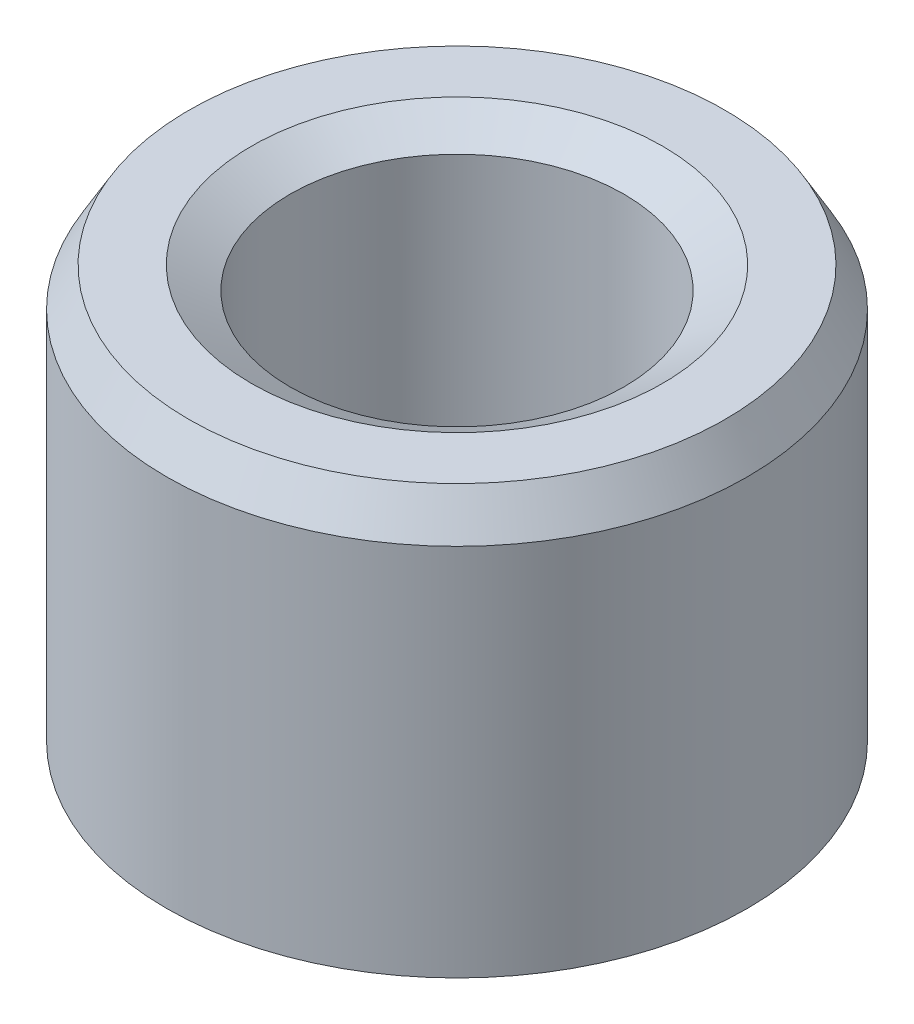
ISO-10303-21;
HEADER;
FILE_DESCRIPTION(('STEP AP214'),'2;1');
FILE_NAME('part.step','',(''),(''),'','','');
FILE_SCHEMA(('AUTOMOTIVE_DESIGN { 1 0 10303 214 1 1 1 1 }'));
ENDSEC;
DATA;
#1=APPLICATION_CONTEXT('core data for automotive mechanical design processes');
#2=APPLICATION_PROTOCOL_DEFINITION('international standard','automotive_design',2000,#1);
#3=PRODUCT_CONTEXT('',#1,'mechanical');
#4=PRODUCT('Part','Part','',(#3));
#5=PRODUCT_RELATED_PRODUCT_CATEGORY('part','',(#4));
#6=PRODUCT_DEFINITION_FORMATION('','',#4);
#7=PRODUCT_DEFINITION_CONTEXT('part definition',#1,'design');
#8=PRODUCT_DEFINITION('design','',#6,#7);
#9=PRODUCT_DEFINITION_SHAPE('','',#8);
#10=(LENGTH_UNIT() NAMED_UNIT(*) SI_UNIT(.MILLI.,.METRE.));
#11=(NAMED_UNIT(*) PLANE_ANGLE_UNIT() SI_UNIT($,.RADIAN.));
#12=(NAMED_UNIT(*) SI_UNIT($,.STERADIAN.) SOLID_ANGLE_UNIT());
#13=UNCERTAINTY_MEASURE_WITH_UNIT(LENGTH_MEASURE(1.E-05),#10,'distance_accuracy_value','');
#14=(GEOMETRIC_REPRESENTATION_CONTEXT(3) GLOBAL_UNCERTAINTY_ASSIGNED_CONTEXT((#13)) GLOBAL_UNIT_ASSIGNED_CONTEXT((#10,
#11,#12)) REPRESENTATION_CONTEXT('',''));
#15=CARTESIAN_POINT('',(0.,0.,0.));
#16=DIRECTION('',(0.,0.,1.));
#17=DIRECTION('',(1.,0.,0.));
#18=AXIS2_PLACEMENT_3D('',#15,#16,#17);
#19=CARTESIAN_POINT('',(0.,26.2063197438059,0.));
#20=DIRECTION('',(0.,-1.,0.));
#21=DIRECTION('',(0.,0.,-1.));
#22=AXIS2_PLACEMENT_3D('',#19,#20,#21);
#23=CYLINDRICAL_SURFACE('',#22,17.5);
#24=CARTESIAN_POINT('',(0.,1.34344800996524,0.));
#25=DIRECTION('',(0.,1.,0.));
#26=DIRECTION('',(0.,0.,1.));
#27=AXIS2_PLACEMENT_3D('',#24,#25,#26);
#28=CIRCLE('',#27,17.5);
#29=CARTESIAN_POINT('',(0.,1.34344800996524,17.5));
#30=VERTEX_POINT('',#29);
#31=EDGE_CURVE('E10',#30,#30,#28,.T.);
#32=ORIENTED_EDGE('',*,*,#31,.T.);
#33=EDGE_LOOP('',(#32));
#34=FACE_BOUND('',#33,.T.);
#35=CARTESIAN_POINT('',(0.,23.8793995332188,0.));
#36=DIRECTION('',(0.,1.,0.));
#37=DIRECTION('',(0.,0.,1.));
#38=AXIS2_PLACEMENT_3D('',#35,#36,#37);
#39=CIRCLE('',#38,17.5);
#40=CARTESIAN_POINT('',(0.,23.8793995332188,17.5));
#41=VERTEX_POINT('',#40);
#42=EDGE_CURVE('E50',#41,#41,#39,.F.);
#43=ORIENTED_EDGE('',*,*,#42,.T.);
#44=EDGE_LOOP('',(#43));
#45=FACE_BOUND('',#44,.T.);
#46=ADVANCED_FACE('F39',(#34,#45),#23,.T.);
#47=CARTESIAN_POINT('',(0.,26.2063197438059,0.));
#48=DIRECTION('',(0.,1.,0.));
#49=DIRECTION('',(0.,0.,1.));
#50=AXIS2_PLACEMENT_3D('',#47,#48,#49);
#51=PLANE('',#50);
#52=CARTESIAN_POINT('',(0.,26.2063197438059,0.));
#53=DIRECTION('',(0.,1.,0.));
#54=DIRECTION('',(0.,0.,1.));
#55=AXIS2_PLACEMENT_3D('',#52,#53,#54);
#56=CIRCLE('',#55,12.3940075327416);
#57=CARTESIAN_POINT('',(0.,26.2063197438059,12.3940075327416));
#58=VERTEX_POINT('',#57);
#59=EDGE_CURVE('E58',#58,#58,#56,.F.);
#60=ORIENTED_EDGE('',*,*,#59,.T.);
#61=EDGE_LOOP('',(#60));
#62=FACE_BOUND('',#61,.T.);
#63=CARTESIAN_POINT('',(0.,26.2063197438059,0.));
#64=DIRECTION('',(0.,1.,0.));
#65=DIRECTION('',(0.,0.,1.));
#66=AXIS2_PLACEMENT_3D('',#63,#64,#65);
#67=CIRCLE('',#66,16.1565519900348);
#68=CARTESIAN_POINT('',(0.,26.2063197438059,16.1565519900348));
#69=VERTEX_POINT('',#68);
#70=EDGE_CURVE('E61',#69,#69,#67,.T.);
#71=ORIENTED_EDGE('',*,*,#70,.T.);
#72=EDGE_LOOP('',(#71));
#73=FACE_BOUND('',#72,.T.);
#74=ADVANCED_FACE('F88',(#62,#73),#51,.T.);
#75=CARTESIAN_POINT('',(0.,0.,0.));
#76=DIRECTION('',(0.,1.,0.));
#77=DIRECTION('',(0.,0.,1.));
#78=AXIS2_PLACEMENT_3D('',#75,#76,#77);
#79=PLANE('',#78);
#80=CARTESIAN_POINT('',(0.,0.,0.));
#81=DIRECTION('',(0.,1.,0.));
#82=DIRECTION('',(0.,0.,1.));
#83=AXIS2_PLACEMENT_3D('',#80,#81,#82);
#84=CIRCLE('',#83,11.4105353321198);
#85=CARTESIAN_POINT('',(0.,0.,-11.4105353321198));
#86=VERTEX_POINT('',#85);
#87=EDGE_CURVE('E51',#86,#86,#84,.T.);
#88=ORIENTED_EDGE('',*,*,#87,.T.);
#89=EDGE_LOOP('',(#88));
#90=FACE_BOUND('',#89,.T.);
#91=CARTESIAN_POINT('',(0.,0.,0.));
#92=DIRECTION('',(0.,1.,0.));
#93=DIRECTION('',(0.,0.,1.));
#94=AXIS2_PLACEMENT_3D('',#91,#92,#93);
#95=CIRCLE('',#94,15.1730797894129);
#96=CARTESIAN_POINT('',(0.,0.,15.1730797894129));
#97=VERTEX_POINT('',#96);
#98=EDGE_CURVE('E54',#97,#97,#95,.F.);
#99=ORIENTED_EDGE('',*,*,#98,.T.);
#100=EDGE_LOOP('',(#99));
#101=FACE_BOUND('',#100,.T.);
#102=ADVANCED_FACE('F83',(#90,#101),#79,.F.);
#103=CARTESIAN_POINT('',(0.,26.2063197438059,0.));
#104=DIRECTION('',(0.,-1.,0.));
#105=DIRECTION('',(0.,0.,-1.));
#106=AXIS2_PLACEMENT_3D('',#103,#104,#105);
#107=CYLINDRICAL_SURFACE('',#106,10.0670873221545);
#108=CARTESIAN_POINT('',(0.,24.8628717338407,0.));
#109=DIRECTION('',(0.,1.,0.));
#110=DIRECTION('',(0.,0.,1.));
#111=AXIS2_PLACEMENT_3D('',#108,#109,#110);
#112=CIRCLE('',#111,10.0670873221545);
#113=CARTESIAN_POINT('',(0.,24.8628717338407,-10.0670873221545));
#114=VERTEX_POINT('',#113);
#115=EDGE_CURVE('E67',#114,#114,#112,.T.);
#116=CARTESIAN_POINT('',(0.,2.32692021058713,0.));
#117=DIRECTION('',(0.,1.,0.));
#118=DIRECTION('',(0.,0.,1.));
#119=AXIS2_PLACEMENT_3D('',#116,#117,#118);
#120=CIRCLE('',#119,10.0670873221545);
#121=CARTESIAN_POINT('',(0.,2.32692021058713,-10.0670873221545));
#122=VERTEX_POINT('',#121);
#123=EDGE_CURVE('E69',#122,#122,#120,.F.);
#124=CARTESIAN_POINT('',(0.,24.8628717338407,-10.0670873221545));
#125=CARTESIAN_POINT('',(0.,24.6281222388068,-10.0670873221545));
#126=CARTESIAN_POINT('',(0.,24.3933727437729,-10.0670873221545));
#127=CARTESIAN_POINT('',(0.,23.9238737537051,-10.0670873221545));
#128=CARTESIAN_POINT('',(0.,23.6891242586712,-10.0670873221545));
#129=CARTESIAN_POINT('',(0.,23.2196252686034,-10.0670873221545));
#130=CARTESIAN_POINT('',(0.,22.9848757735695,-10.0670873221545));
#131=CARTESIAN_POINT('',(0.,22.5153767835017,-10.0670873221545));
#132=CARTESIAN_POINT('',(0.,22.2806272884679,-10.0670873221545));
#133=CARTESIAN_POINT('',(0.,21.8111282984001,-10.0670873221545));
#134=CARTESIAN_POINT('',(0.,21.5763788033662,-10.0670873221545));
#135=CARTESIAN_POINT('',(0.,21.1068798132984,-10.0670873221545));
#136=CARTESIAN_POINT('',(0.,20.8721303182645,-10.0670873221545));
#137=CARTESIAN_POINT('',(0.,20.4026313281967,-10.0670873221545));
#138=CARTESIAN_POINT('',(0.,20.1678818331628,-10.0670873221545));
#139=CARTESIAN_POINT('',(0.,19.6983828430951,-10.0670873221545));
#140=CARTESIAN_POINT('',(0.,19.4636333480612,-10.0670873221545));
#141=CARTESIAN_POINT('',(0.,18.9941343579934,-10.0670873221545));
#142=CARTESIAN_POINT('',(0.,18.7593848629595,-10.0670873221545));
#143=CARTESIAN_POINT('',(0.,18.2898858728917,-10.0670873221545));
#144=CARTESIAN_POINT('',(0.,18.0551363778578,-10.0670873221545));
#145=CARTESIAN_POINT('',(0.,17.58563738779,-10.0670873221545));
#146=CARTESIAN_POINT('',(0.,17.3508878927561,-10.0670873221545));
#147=CARTESIAN_POINT('',(0.,16.8813889026884,-10.0670873221545));
#148=CARTESIAN_POINT('',(0.,16.6466394076545,-10.0670873221545));
#149=CARTESIAN_POINT('',(0.,16.1771404175867,-10.0670873221545));
#150=CARTESIAN_POINT('',(0.,15.9423909225528,-10.0670873221545));
#151=CARTESIAN_POINT('',(0.,15.472891932485,-10.0670873221545));
#152=CARTESIAN_POINT('',(0.,15.2381424374511,-10.0670873221545));
#153=CARTESIAN_POINT('',(0.,14.7686434473833,-10.0670873221545));
#154=CARTESIAN_POINT('',(0.,14.5338939523495,-10.0670873221545));
#155=CARTESIAN_POINT('',(0.,14.0643949622817,-10.0670873221545));
#156=CARTESIAN_POINT('',(0.,13.8296454672478,-10.0670873221545));
#157=CARTESIAN_POINT('',(0.,13.36014647718,-10.0670873221545));
#158=CARTESIAN_POINT('',(0.,13.1253969821461,-10.0670873221545));
#159=CARTESIAN_POINT('',(0.,12.6558979920783,-10.0670873221545));
#160=CARTESIAN_POINT('',(0.,12.4211484970444,-10.0670873221545));
#161=CARTESIAN_POINT('',(0.,11.9516495069767,-10.0670873221545));
#162=CARTESIAN_POINT('',(0.,11.7169000119428,-10.0670873221545));
#163=CARTESIAN_POINT('',(0.,11.247401021875,-10.0670873221545));
#164=CARTESIAN_POINT('',(0.,11.0126515268411,-10.0670873221545));
#165=CARTESIAN_POINT('',(0.,10.5431525367733,-10.0670873221545));
#166=CARTESIAN_POINT('',(0.,10.3084030417394,-10.0670873221545));
#167=CARTESIAN_POINT('',(0.,9.83890405167164,-10.0670873221545));
#168=CARTESIAN_POINT('',(0.,9.60415455663774,-10.0670873221545));
#169=CARTESIAN_POINT('',(0.,9.13465556656996,-10.0670873221545));
#170=CARTESIAN_POINT('',(0.,8.89990607153607,-10.0670873221545));
#171=CARTESIAN_POINT('',(0.,8.43040708146829,-10.0670873221545));
#172=CARTESIAN_POINT('',(0.,8.1956575864344,-10.0670873221545));
#173=CARTESIAN_POINT('',(0.,7.72615859636662,-10.0670873221545));
#174=CARTESIAN_POINT('',(0.,7.49140910133273,-10.0670873221545));
#175=CARTESIAN_POINT('',(0.,7.02191011126494,-10.0670873221545));
#176=CARTESIAN_POINT('',(0.,6.78716061623106,-10.0670873221545));
#177=CARTESIAN_POINT('',(0.,6.31766162616327,-10.0670873221545));
#178=CARTESIAN_POINT('',(0.,6.08291213112938,-10.0670873221545));
#179=CARTESIAN_POINT('',(0.,5.6134131410616,-10.0670873221545));
#180=CARTESIAN_POINT('',(0.,5.37866364602771,-10.0670873221545));
#181=CARTESIAN_POINT('',(0.,4.90916465595992,-10.0670873221545));
#182=CARTESIAN_POINT('',(0.,4.67441516092603,-10.0670873221545));
#183=CARTESIAN_POINT('',(0.,4.20491617085825,-10.0670873221545));
#184=CARTESIAN_POINT('',(0.,3.97016667582436,-10.0670873221545));
#185=CARTESIAN_POINT('',(0.,3.50066768575658,-10.0670873221545));
#186=CARTESIAN_POINT('',(0.,3.26591819072269,-10.0670873221545));
#187=CARTESIAN_POINT('',(0.,2.79641920065491,-10.0670873221545));
#188=CARTESIAN_POINT('',(0.,2.56166970562102,-10.0670873221545));
#189=CARTESIAN_POINT('',(0.,2.32692021058713,-10.0670873221545));
#190=B_SPLINE_CURVE_WITH_KNOTS('',3,(#124,#125,#126,#127,#128,#129,#130,#131,#132,#133,#134,
#135,#136,#137,#138,#139,#140,#141,#142,#143,#144,#145,#146,#147,#148,#149,#150,#151,#152,#153,
#154,#155,#156,#157,#158,#159,#160,#161,#162,#163,#164,#165,#166,#167,#168,#169,#170,#171,#172,
#173,#174,#175,#176,#177,#178,#179,#180,#181,#182,#183,#184,#185,#186,#187,#188,#189),
.UNSPECIFIED.,.F.,.F.,(4,2,2,2,2,2,2,2,2,2,2,2,2,2,2,2,2,2,2,2,2,2,2,2,2,2,2,2,2,2,2,2,4),(0.,
0.704248485101675,1.40849697020335,2.11274545530502,2.81699394040669,3.52124242550837,
4.22549091061004,4.92973939571171,5.63398788081338,6.33823636591506,7.04248485101673,
7.7467333361184,8.45098182122007,9.15523030632175,9.85947879142342,10.5637272765251,
11.2679757616268,11.9722242467284,12.6764727318301,13.3807212169318,14.0849697020335,
14.7892181871351,15.4934666722368,16.1977151573385,16.9019636424401,17.6062121275418,
18.3104606126435,19.0147090977452,19.7189575828468,20.4232060679485,21.1274545530502,
21.8317030381519,22.5359515232535),.UNSPECIFIED.);
#191=EDGE_CURVE('BSEAM71',#114,#122,#190,.T.);
#192=ORIENTED_EDGE('',*,*,#115,.T.);
#193=ORIENTED_EDGE('',*,*,#123,.T.);
#194=ORIENTED_EDGE('',*,*,#191,.T.);
#195=ORIENTED_EDGE('',*,*,#191,.F.);
#196=EDGE_LOOP('',(#192,#194,#193,#195));
#197=FACE_BOUND('',#196,.T.);
#198=ADVANCED_FACE('F71',(#197),#107,.F.);
#199=CARTESIAN_POINT('',(0.,24.8628717338407,0.));
#200=DIRECTION('',(0.,1.,0.));
#201=DIRECTION('',(0.,0.,1.));
#202=AXIS2_PLACEMENT_3D('',#199,#200,#201);
#203=CONICAL_SURFACE('',#202,10.0670873221545,1.0471975511966);
#204=ORIENTED_EDGE('',*,*,#59,.F.);
#205=EDGE_LOOP('',(#204));
#206=FACE_BOUND('',#205,.T.);
#207=ORIENTED_EDGE('',*,*,#115,.F.);
#208=EDGE_LOOP('',(#207));
#209=FACE_BOUND('',#208,.T.);
#210=ADVANCED_FACE('F77',(#206,#209),#203,.F.);
#211=CARTESIAN_POINT('',(0.,0.,0.));
#212=DIRECTION('',(0.,-1.,0.));
#213=DIRECTION('',(0.,0.,-1.));
#214=AXIS2_PLACEMENT_3D('',#211,#212,#213);
#215=CONICAL_SURFACE('',#214,11.4105353321198,0.523598775598295);
#216=CARTESIAN_POINT('',(0.,2.32692021058713,-10.0670873221545));
#217=CARTESIAN_POINT('',(0.,2.30268145839351,-10.0810815722583));
#218=CARTESIAN_POINT('',(0.,2.2784427061999,-10.0950758223621));
#219=CARTESIAN_POINT('',(0.,2.22996520181267,-10.1230643225697));
#220=CARTESIAN_POINT('',(0.,2.20572644961905,-10.1370585726735));
#221=CARTESIAN_POINT('',(0.,2.15724894523182,-10.1650470728811));
#222=CARTESIAN_POINT('',(0.,2.1330101930382,-10.1790413229849));
#223=CARTESIAN_POINT('',(0.,2.08453268865097,-10.2070298231926));
#224=CARTESIAN_POINT('',(0.,2.06029393645735,-10.2210240732964));
#225=CARTESIAN_POINT('',(0.,2.01181643207012,-10.249012573504));
#226=CARTESIAN_POINT('',(0.,1.98757767987651,-10.2630068236078));
#227=CARTESIAN_POINT('',(0.,1.93910017548928,-10.2909953238154));
#228=CARTESIAN_POINT('',(0.,1.91486142329566,-10.3049895739192));
#229=CARTESIAN_POINT('',(0.,1.86638391890843,-10.3329780741268));
#230=CARTESIAN_POINT('',(0.,1.84214516671481,-10.3469723242306));
#231=CARTESIAN_POINT('',(0.,1.79366766232758,-10.3749608244382));
#232=CARTESIAN_POINT('',(0.,1.76942891013396,-10.388955074542));
#233=CARTESIAN_POINT('',(0.,1.72095140574673,-10.4169435747496));
#234=CARTESIAN_POINT('',(0.,1.69671265355312,-10.4309378248534));
#235=CARTESIAN_POINT('',(0.,1.64823514916588,-10.458926325061));
#236=CARTESIAN_POINT('',(0.,1.62399639697227,-10.4729205751648));
#237=CARTESIAN_POINT('',(0.,1.57551889258504,-10.5009090753725));
#238=CARTESIAN_POINT('',(0.,1.55128014039142,-10.5149033254763));
#239=CARTESIAN_POINT('',(0.,1.50280263600419,-10.5428918256839));
#240=CARTESIAN_POINT('',(0.,1.47856388381057,-10.5568860757877));
#241=CARTESIAN_POINT('',(0.,1.43008637942334,-10.5848745759953));
#242=CARTESIAN_POINT('',(0.,1.40584762722972,-10.5988688260991));
#243=CARTESIAN_POINT('',(0.,1.35737012284249,-10.6268573263067));
#244=CARTESIAN_POINT('',(0.,1.33313137064888,-10.6408515764105));
#245=CARTESIAN_POINT('',(0.,1.28465386626164,-10.6688400766181));
#246=CARTESIAN_POINT('',(0.,1.26041511406803,-10.6828343267219));
#247=CARTESIAN_POINT('',(0.,1.2119376096808,-10.7108228269295));
#248=CARTESIAN_POINT('',(0.,1.18769885748718,-10.7248170770333));
#249=CARTESIAN_POINT('',(0.,1.13922135309995,-10.7528055772409));
#250=CARTESIAN_POINT('',(0.,1.11498260090633,-10.7667998273447));
#251=CARTESIAN_POINT('',(0.,1.0665050965191,-10.7947883275524));
#252=CARTESIAN_POINT('',(0.,1.04226634432549,-10.8087825776562));
#253=CARTESIAN_POINT('',(0.,0.993788839938254,-10.8367710778638));
#254=CARTESIAN_POINT('',(0.,0.969550087744637,-10.8507653279676));
#255=CARTESIAN_POINT('',(0.,0.921072583357406,-10.8787538281752));
#256=CARTESIAN_POINT('',(0.,0.89683383116379,-10.892748078279));
#257=CARTESIAN_POINT('',(0.,0.848356326776558,-10.9207365784866));
#258=CARTESIAN_POINT('',(0.,0.824117574582942,-10.9347308285904));
#259=CARTESIAN_POINT('',(0.,0.77564007019571,-10.962719328798));
#260=CARTESIAN_POINT('',(0.,0.751401318002094,-10.9767135789018));
#261=CARTESIAN_POINT('',(0.,0.702923813614862,-11.0047020791094));
#262=CARTESIAN_POINT('',(0.,0.678685061421246,-11.0186963292132));
#263=CARTESIAN_POINT('',(0.,0.630207557034014,-11.0466848294208));
#264=CARTESIAN_POINT('',(0.,0.605968804840399,-11.0606790795246));
#265=CARTESIAN_POINT('',(0.,0.557491300453167,-11.0886675797323));
#266=CARTESIAN_POINT('',(0.,0.533252548259551,-11.1026618298361));
#267=CARTESIAN_POINT('',(0.,0.484775043872319,-11.1306503300437));
#268=CARTESIAN_POINT('',(0.,0.460536291678703,-11.1446445801475));
#269=CARTESIAN_POINT('',(0.,0.412058787291471,-11.1726330803551));
#270=CARTESIAN_POINT('',(0.,0.387820035097855,-11.1866273304589));
#271=CARTESIAN_POINT('',(0.,0.339342530710623,-11.2146158306665));
#272=CARTESIAN_POINT('',(0.,0.315103778517007,-11.2286100807703));
#273=CARTESIAN_POINT('',(0.,0.266626274129776,-11.2565985809779));
#274=CARTESIAN_POINT('',(0.,0.242387521936159,-11.2705928310817));
#275=CARTESIAN_POINT('',(0.,0.193910017548927,-11.2985813312893));
#276=CARTESIAN_POINT('',(0.,0.169671265355311,-11.3125755813931));
#277=CARTESIAN_POINT('',(0.,0.12119376096808,-11.3405640816007));
#278=CARTESIAN_POINT('',(0.,0.0969550087744637,-11.3545583317045));
#279=CARTESIAN_POINT('',(0.,0.048477504387232,-11.3825468319122));
#280=CARTESIAN_POINT('',(0.,0.0242387521936161,-11.396541082016));
#281=CARTESIAN_POINT('',(0.,0.,-11.4105353321198));
#282=B_SPLINE_CURVE_WITH_KNOTS('',3,(#216,#217,#218,#219,#220,#221,#222,#223,#224,#225,#226,
#227,#228,#229,#230,#231,#232,#233,#234,#235,#236,#237,#238,#239,#240,#241,#242,#243,#244,#245,
#246,#247,#248,#249,#250,#251,#252,#253,#254,#255,#256,#257,#258,#259,#260,#261,#262,#263,#264,
#265,#266,#267,#268,#269,#270,#271,#272,#273,#274,#275,#276,#277,#278,#279,#280,#281),
.UNSPECIFIED.,.F.,.F.,(4,2,2,2,2,2,2,2,2,2,2,2,2,2,2,2,2,2,2,2,2,2,2,2,2,2,2,2,2,2,2,2,4),(0.,
0.0839655006228289,0.167931001245657,0.251896501868486,0.335862002491314,0.419827503114143,
0.503793003736971,0.5877585043598,0.671724004982629,0.755689505605457,0.839655006228286,
0.923620506851115,1.00758600747394,1.09155150809677,1.1755170087196,1.25948250934243,
1.34344800996526,1.42741351058809,1.51137901121091,1.59534451183374,1.67931001245657,
1.7632755130794,1.84724101370223,1.93120651432506,2.01517201494789,2.09913751557071,
2.18310301619354,2.26706851681637,2.3510340174392,2.43499951806203,2.51896501868486,
2.60293051930769,2.68689601993051),.UNSPECIFIED.);
#283=EDGE_CURVE('BSEAM73',#122,#86,#282,.T.);
#284=ORIENTED_EDGE('',*,*,#123,.F.);
#285=ORIENTED_EDGE('',*,*,#87,.F.);
#286=ORIENTED_EDGE('',*,*,#283,.T.);
#287=ORIENTED_EDGE('',*,*,#283,.F.);
#288=EDGE_LOOP('',(#284,#286,#285,#287));
#289=FACE_BOUND('',#288,.T.);
#290=ADVANCED_FACE('F73',(#289),#215,.F.);
#291=CARTESIAN_POINT('',(0.,1.34344800996524,0.));
#292=DIRECTION('',(0.,1.,0.));
#293=DIRECTION('',(0.,0.,1.));
#294=AXIS2_PLACEMENT_3D('',#291,#292,#293);
#295=CONICAL_SURFACE('',#294,17.5,1.0471975511966);
#296=CARTESIAN_POINT('',(0.,0.,15.1730797894129));
#297=CARTESIAN_POINT('',(0.,0.0139942501038044,15.1973185416065));
#298=CARTESIAN_POINT('',(0.,0.027988500207609,15.2215572938001));
#299=CARTESIAN_POINT('',(0.,0.0559770004152182,15.2700347981873));
#300=CARTESIAN_POINT('',(0.,0.0699712505190228,15.294273550381));
#301=CARTESIAN_POINT('',(0.,0.0979597507266319,15.3427510547682));
#302=CARTESIAN_POINT('',(0.,0.111954000830437,15.3669898069618));
#303=CARTESIAN_POINT('',(0.,0.139942501038046,15.415467311349));
#304=CARTESIAN_POINT('',(0.,0.15393675114185,15.4397060635427));
#305=CARTESIAN_POINT('',(0.,0.18192525134946,15.4881835679299));
#306=CARTESIAN_POINT('',(0.,0.195919501453264,15.5124223201235));
#307=CARTESIAN_POINT('',(0.,0.223908001660873,15.5608998245107));
#308=CARTESIAN_POINT('',(0.,0.237902251764678,15.5851385767044));
#309=CARTESIAN_POINT('',(0.,0.265890751972287,15.6336160810916));
#310=CARTESIAN_POINT('',(0.,0.279885002076092,15.6578548332852));
#311=CARTESIAN_POINT('',(0.,0.307873502283701,15.7063323376724));
#312=CARTESIAN_POINT('',(0.,0.321867752387505,15.730571089866));
#313=CARTESIAN_POINT('',(0.,0.349856252595115,15.7790485942533));
#314=CARTESIAN_POINT('',(0.,0.363850502698919,15.8032873464469));
#315=CARTESIAN_POINT('',(0.,0.391839002906528,15.8517648508341));
#316=CARTESIAN_POINT('',(0.,0.405833253010333,15.8760036030277));
#317=CARTESIAN_POINT('',(0.,0.433821753217942,15.924481107415));
#318=CARTESIAN_POINT('',(0.,0.447816003321747,15.9487198596086));
#319=CARTESIAN_POINT('',(0.,0.475804503529356,15.9971973639958));
#320=CARTESIAN_POINT('',(0.,0.489798753633161,16.0214361161894));
#321=CARTESIAN_POINT('',(0.,0.51778725384077,16.0699136205767));
#322=CARTESIAN_POINT('',(0.,0.531781503944574,16.0941523727703));
#323=CARTESIAN_POINT('',(0.,0.559770004152184,16.1426298771575));
#324=CARTESIAN_POINT('',(0.,0.573764254255988,16.1668686293511));
#325=CARTESIAN_POINT('',(0.,0.601752754463597,16.2153461337384));
#326=CARTESIAN_POINT('',(0.,0.615747004567402,16.239584885932));
#327=CARTESIAN_POINT('',(0.,0.643735504775011,16.2880623903192));
#328=CARTESIAN_POINT('',(0.,0.657729754878816,16.3123011425128));
#329=CARTESIAN_POINT('',(0.,0.685718255086425,16.3607786469001));
#330=CARTESIAN_POINT('',(0.,0.699712505190229,16.3850173990937));
#331=CARTESIAN_POINT('',(0.,0.727701005397838,16.4334949034809));
#332=CARTESIAN_POINT('',(0.,0.741695255501643,16.4577336556745));
#333=CARTESIAN_POINT('',(0.,0.769683755709253,16.5062111600618));
#334=CARTESIAN_POINT('',(0.,0.783678005813057,16.5304499122554));
#335=CARTESIAN_POINT('',(0.,0.811666506020666,16.5789274166426));
#336=CARTESIAN_POINT('',(0.,0.825660756124471,16.6031661688362));
#337=CARTESIAN_POINT('',(0.,0.85364925633208,16.6516436732235));
#338=CARTESIAN_POINT('',(0.,0.867643506435885,16.6758824254171));
#339=CARTESIAN_POINT('',(0.,0.895632006643494,16.7243599298043));
#340=CARTESIAN_POINT('',(0.,0.909626256747299,16.7485986819979));
#341=CARTESIAN_POINT('',(0.,0.937614756954908,16.7970761863851));
#342=CARTESIAN_POINT('',(0.,0.951609007058712,16.8213149385788));
#343=CARTESIAN_POINT('',(0.,0.979597507266322,16.869792442966));
#344=CARTESIAN_POINT('',(0.,0.993591757370126,16.8940311951596));
#345=CARTESIAN_POINT('',(0.,1.02158025757774,16.9425086995468));
#346=CARTESIAN_POINT('',(0.,1.03557450768154,16.9667474517405));
#347=CARTESIAN_POINT('',(0.,1.06356300788915,17.0152249561277));
#348=CARTESIAN_POINT('',(0.,1.07755725799295,17.0394637083213));
#349=CARTESIAN_POINT('',(0.,1.10554575820056,17.0879412127085));
#350=CARTESIAN_POINT('',(0.,1.11954000830437,17.1121799649022));
#351=CARTESIAN_POINT('',(0.,1.14752850851198,17.1606574692894));
#352=CARTESIAN_POINT('',(0.,1.16152275861578,17.184896221483));
#353=CARTESIAN_POINT('',(0.,1.18951125882339,17.2333737258702));
#354=CARTESIAN_POINT('',(0.,1.20350550892719,17.2576124780638));
#355=CARTESIAN_POINT('',(0.,1.2314940091348,17.3060899824511));
#356=CARTESIAN_POINT('',(0.,1.24548825923861,17.3303287346447));
#357=CARTESIAN_POINT('',(0.,1.27347675944622,17.3788062390319));
#358=CARTESIAN_POINT('',(0.,1.28747100955002,17.4030449912255));
#359=CARTESIAN_POINT('',(0.,1.31545950975763,17.4515224956128));
#360=CARTESIAN_POINT('',(0.,1.32945375986144,17.4757612478064));
#361=CARTESIAN_POINT('',(0.,1.34344800996524,17.5));
#362=B_SPLINE_CURVE_WITH_KNOTS('',3,(#296,#297,#298,#299,#300,#301,#302,#303,#304,#305,#306,
#307,#308,#309,#310,#311,#312,#313,#314,#315,#316,#317,#318,#319,#320,#321,#322,#323,#324,#325,
#326,#327,#328,#329,#330,#331,#332,#333,#334,#335,#336,#337,#338,#339,#340,#341,#342,#343,#344,
#345,#346,#347,#348,#349,#350,#351,#352,#353,#354,#355,#356,#357,#358,#359,#360,#361),
.UNSPECIFIED.,.F.,.F.,(4,2,2,2,2,2,2,2,2,2,2,2,2,2,2,2,2,2,2,2,2,2,2,2,2,2,2,2,2,2,2,2,4),(0.,
0.083965500622828,0.167931001245656,0.251896501868484,0.335862002491312,0.41982750311414,
0.503793003736969,0.587758504359799,0.671724004982627,0.755689505605455,0.839655006228283,
0.923620506851111,1.00758600747394,1.09155150809677,1.1755170087196,1.25948250934242,
1.34344800996525,1.42741351058808,1.51137901121091,1.59534451183374,1.67931001245657,
1.76327551307939,1.84724101370222,1.93120651432505,2.01517201494788,2.09913751557071,
2.18310301619353,2.26706851681637,2.35103401743919,2.43499951806202,2.51896501868485,
2.60293051930768,2.68689601993051),.UNSPECIFIED.);
#363=EDGE_CURVE('BSEAM76',#97,#30,#362,.T.);
#364=ORIENTED_EDGE('',*,*,#98,.F.);
#365=ORIENTED_EDGE('',*,*,#31,.F.);
#366=ORIENTED_EDGE('',*,*,#363,.T.);
#367=ORIENTED_EDGE('',*,*,#363,.F.);
#368=EDGE_LOOP('',(#364,#366,#365,#367));
#369=FACE_BOUND('',#368,.T.);
#370=ADVANCED_FACE('F76',(#369),#295,.T.);
#371=CARTESIAN_POINT('',(0.,26.2063197438059,0.));
#372=DIRECTION('',(0.,-1.,0.));
#373=DIRECTION('',(0.,0.,-1.));
#374=AXIS2_PLACEMENT_3D('',#371,#372,#373);
#375=CONICAL_SURFACE('',#374,16.1565519900348,0.523598775598295);
#376=ORIENTED_EDGE('',*,*,#42,.F.);
#377=EDGE_LOOP('',(#376));
#378=FACE_BOUND('',#377,.T.);
#379=ORIENTED_EDGE('',*,*,#70,.F.);
#380=EDGE_LOOP('',(#379));
#381=FACE_BOUND('',#380,.T.);
#382=ADVANCED_FACE('F45',(#378,#381),#375,.T.);
#383=CLOSED_SHELL('',(#46,#74,#102,#198,#210,#290,#370,#382));
#384=MANIFOLD_SOLID_BREP('B2',#383);
#385=ADVANCED_BREP_SHAPE_REPRESENTATION('',(#18,#384),#14);
#386=SHAPE_DEFINITION_REPRESENTATION(#9,#385);
ENDSEC;
END-ISO-10303-21;
